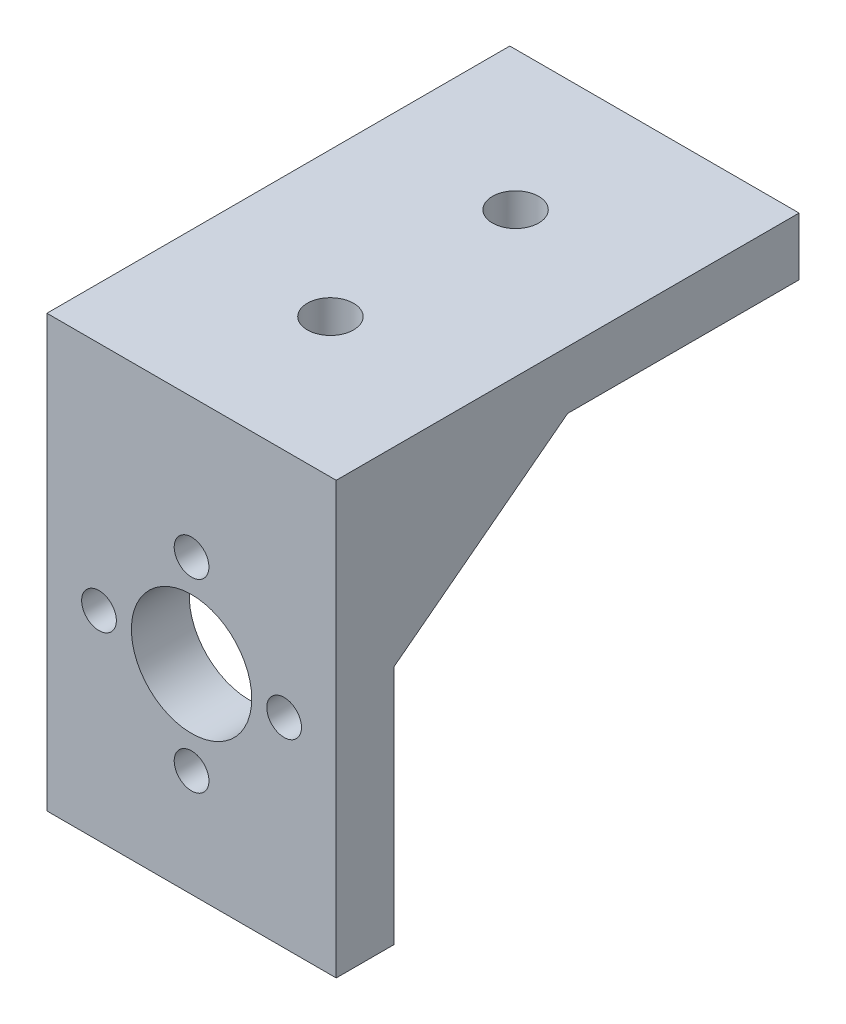
ISO-10303-21;
HEADER;
FILE_DESCRIPTION(('STEP AP214'),'2;1');
FILE_NAME('part.step','',(''),(''),'','','');
FILE_SCHEMA(('AUTOMOTIVE_DESIGN { 1 0 10303 214 1 1 1 1 }'));
ENDSEC;
DATA;
#1=APPLICATION_CONTEXT('core data for automotive mechanical design processes');
#2=APPLICATION_PROTOCOL_DEFINITION('international standard','automotive_design',2000,#1);
#3=PRODUCT_CONTEXT('',#1,'mechanical');
#4=PRODUCT('Part','Part','',(#3));
#5=PRODUCT_RELATED_PRODUCT_CATEGORY('part','',(#4));
#6=PRODUCT_DEFINITION_FORMATION('','',#4);
#7=PRODUCT_DEFINITION_CONTEXT('part definition',#1,'design');
#8=PRODUCT_DEFINITION('design','',#6,#7);
#9=PRODUCT_DEFINITION_SHAPE('','',#8);
#10=(LENGTH_UNIT() NAMED_UNIT(*) SI_UNIT(.MILLI.,.METRE.));
#11=(NAMED_UNIT(*) PLANE_ANGLE_UNIT() SI_UNIT($,.RADIAN.));
#12=(NAMED_UNIT(*) SI_UNIT($,.STERADIAN.) SOLID_ANGLE_UNIT());
#13=UNCERTAINTY_MEASURE_WITH_UNIT(LENGTH_MEASURE(1.E-05),#10,'distance_accuracy_value','');
#14=(GEOMETRIC_REPRESENTATION_CONTEXT(3) GLOBAL_UNCERTAINTY_ASSIGNED_CONTEXT((#13)) GLOBAL_UNIT_ASSIGNED_CONTEXT((#10,
#11,#12)) REPRESENTATION_CONTEXT('',''));
#15=CARTESIAN_POINT('',(0.,0.,0.));
#16=DIRECTION('',(0.,0.,1.));
#17=DIRECTION('',(1.,0.,0.));
#18=AXIS2_PLACEMENT_3D('',#15,#16,#17);
#19=CARTESIAN_POINT('',(0.,0.,0.));
#20=DIRECTION('',(0.,-1.,0.));
#21=DIRECTION('',(0.,0.,-1.));
#22=AXIS2_PLACEMENT_3D('',#19,#20,#21);
#23=PLANE('',#22);
#24=CARTESIAN_POINT('',(0.,0.,8.));
#25=DIRECTION('',(0.,-1.,0.));
#26=DIRECTION('',(0.,0.,-1.));
#27=AXIS2_PLACEMENT_3D('',#24,#25,#26);
#28=CIRCLE('',#27,2.);
#29=CARTESIAN_POINT('',(0.,0.,6.));
#30=VERTEX_POINT('',#29);
#31=EDGE_CURVE('E184',#30,#30,#28,.F.);
#32=ORIENTED_EDGE('',*,*,#31,.T.);
#33=EDGE_LOOP('',(#32));
#34=FACE_BOUND('',#33,.T.);
#35=CARTESIAN_POINT('',(0.,0.,-8.));
#36=DIRECTION('',(0.,-1.,0.));
#37=DIRECTION('',(0.,0.,-1.));
#38=AXIS2_PLACEMENT_3D('',#35,#36,#37);
#39=CIRCLE('',#38,2.);
#40=CARTESIAN_POINT('',(0.,0.,-10.));
#41=VERTEX_POINT('',#40);
#42=EDGE_CURVE('E188',#41,#41,#39,.T.);
#43=ORIENTED_EDGE('',*,*,#42,.F.);
#44=EDGE_LOOP('',(#43));
#45=FACE_BOUND('',#44,.T.);
#46=DIRECTION('',(0.,0.,-1.));
#47=VECTOR('',#46,1.);
#48=CARTESIAN_POINT('',(12.5,0.,-20.));
#49=LINE('',#48,#47);
#50=CARTESIAN_POINT('',(12.5,0.,0.));
#51=VERTEX_POINT('',#50);
#52=CARTESIAN_POINT('',(12.5,0.,-20.));
#53=VERTEX_POINT('',#52);
#54=EDGE_CURVE('E202',#51,#53,#49,.T.);
#55=ORIENTED_EDGE('',*,*,#54,.F.);
#56=DIRECTION('',(1.,0.,0.));
#57=VECTOR('',#56,1.);
#58=CARTESIAN_POINT('',(9.5,0.,0.));
#59=LINE('',#58,#57);
#60=CARTESIAN_POINT('',(9.5,0.,0.));
#61=VERTEX_POINT('',#60);
#62=EDGE_CURVE('E128',#61,#51,#59,.T.);
#63=ORIENTED_EDGE('',*,*,#62,.F.);
#64=DIRECTION('',(0.,0.,-1.));
#65=VECTOR('',#64,1.);
#66=CARTESIAN_POINT('',(9.5,0.,15.));
#67=LINE('',#66,#65);
#68=CARTESIAN_POINT('',(9.5,0.,15.));
#69=VERTEX_POINT('',#68);
#70=EDGE_CURVE('E116',#69,#61,#67,.T.);
#71=ORIENTED_EDGE('',*,*,#70,.F.);
#72=DIRECTION('',(1.,0.,0.));
#73=VECTOR('',#72,1.);
#74=CARTESIAN_POINT('',(12.5,0.,15.));
#75=LINE('',#74,#73);
#76=CARTESIAN_POINT('',(-9.49999999999999,0.,15.));
#77=VERTEX_POINT('',#76);
#78=EDGE_CURVE('E132',#77,#69,#75,.T.);
#79=ORIENTED_EDGE('',*,*,#78,.F.);
#80=DIRECTION('',(0.,0.,-1.));
#81=VECTOR('',#80,1.);
#82=CARTESIAN_POINT('',(-9.5,0.,15.));
#83=LINE('',#82,#81);
#84=CARTESIAN_POINT('',(-9.5,0.,0.));
#85=VERTEX_POINT('',#84);
#86=EDGE_CURVE('E50',#77,#85,#83,.T.);
#87=ORIENTED_EDGE('',*,*,#86,.T.);
#88=DIRECTION('',(-1.,0.,0.));
#89=VECTOR('',#88,1.);
#90=CARTESIAN_POINT('',(-9.5,0.,0.));
#91=LINE('',#90,#89);
#92=CARTESIAN_POINT('',(-12.5,0.,0.));
#93=VERTEX_POINT('',#92);
#94=EDGE_CURVE('E54',#85,#93,#91,.T.);
#95=ORIENTED_EDGE('',*,*,#94,.T.);
#96=DIRECTION('',(0.,0.,1.));
#97=VECTOR('',#96,1.);
#98=CARTESIAN_POINT('',(-12.5,0.,-20.));
#99=LINE('',#98,#97);
#100=CARTESIAN_POINT('',(-12.5,0.,-20.));
#101=VERTEX_POINT('',#100);
#102=EDGE_CURVE('E200',#101,#93,#99,.T.);
#103=ORIENTED_EDGE('',*,*,#102,.F.);
#104=DIRECTION('',(-1.,0.,0.));
#105=VECTOR('',#104,1.);
#106=CARTESIAN_POINT('',(12.5,0.,-20.));
#107=LINE('',#106,#105);
#108=EDGE_CURVE('E193',#53,#101,#107,.T.);
#109=ORIENTED_EDGE('',*,*,#108,.F.);
#110=EDGE_LOOP('',(#55,#63,#71,#79,#87,#95,#103,#109));
#111=FACE_BOUND('',#110,.T.);
#112=ADVANCED_FACE('F33',(#34,#45,#111),#23,.T.);
#113=CARTESIAN_POINT('',(12.5,-32.25,15.));
#114=DIRECTION('',(0.,0.,1.));
#115=DIRECTION('',(1.,0.,0.));
#116=AXIS2_PLACEMENT_3D('',#113,#114,#115);
#117=PLANE('',#116);
#118=CARTESIAN_POINT('',(0.,-15.,15.));
#119=DIRECTION('',(0.,0.,1.));
#120=DIRECTION('',(1.,0.,0.));
#121=AXIS2_PLACEMENT_3D('',#118,#119,#120);
#122=CIRCLE('',#121,5.2);
#123=CARTESIAN_POINT('',(5.2,-15.,15.));
#124=VERTEX_POINT('',#123);
#125=EDGE_CURVE('E37',#124,#124,#122,.T.);
#126=ORIENTED_EDGE('',*,*,#125,.T.);
#127=EDGE_LOOP('',(#126));
#128=FACE_BOUND('',#127,.T.);
#129=CARTESIAN_POINT('',(0.,-7.,15.));
#130=DIRECTION('',(0.,0.,1.));
#131=DIRECTION('',(1.,0.,0.));
#132=AXIS2_PLACEMENT_3D('',#129,#130,#131);
#133=CIRCLE('',#132,1.5);
#134=CARTESIAN_POINT('',(1.5,-7.,15.));
#135=VERTEX_POINT('',#134);
#136=EDGE_CURVE('E163',#135,#135,#133,.T.);
#137=ORIENTED_EDGE('',*,*,#136,.T.);
#138=EDGE_LOOP('',(#137));
#139=FACE_BOUND('',#138,.T.);
#140=CARTESIAN_POINT('',(8.,-14.9999999999999,15.));
#141=DIRECTION('',(0.,0.,1.));
#142=DIRECTION('',(1.,0.,0.));
#143=AXIS2_PLACEMENT_3D('',#140,#141,#142);
#144=CIRCLE('',#143,1.5);
#145=CARTESIAN_POINT('',(9.5,-14.9999999999999,15.));
#146=VERTEX_POINT('',#145);
#147=EDGE_CURVE('E153',#146,#146,#144,.T.);
#148=ORIENTED_EDGE('',*,*,#147,.T.);
#149=EDGE_LOOP('',(#148));
#150=FACE_BOUND('',#149,.T.);
#151=CARTESIAN_POINT('',(0.,-23.,15.));
#152=DIRECTION('',(0.,0.,1.));
#153=DIRECTION('',(1.,0.,0.));
#154=AXIS2_PLACEMENT_3D('',#151,#152,#153);
#155=CIRCLE('',#154,1.5);
#156=CARTESIAN_POINT('',(1.5,-23.,15.));
#157=VERTEX_POINT('',#156);
#158=EDGE_CURVE('E157',#157,#157,#155,.T.);
#159=ORIENTED_EDGE('',*,*,#158,.T.);
#160=EDGE_LOOP('',(#159));
#161=FACE_BOUND('',#160,.T.);
#162=CARTESIAN_POINT('',(-8.,-15.,15.));
#163=DIRECTION('',(0.,0.,1.));
#164=DIRECTION('',(1.,0.,0.));
#165=AXIS2_PLACEMENT_3D('',#162,#163,#164);
#166=CIRCLE('',#165,1.5);
#167=CARTESIAN_POINT('',(-6.5,-15.,15.));
#168=VERTEX_POINT('',#167);
#169=EDGE_CURVE('E160',#168,#168,#166,.T.);
#170=ORIENTED_EDGE('',*,*,#169,.T.);
#171=EDGE_LOOP('',(#170));
#172=FACE_BOUND('',#171,.T.);
#173=DIRECTION('',(1.,0.,0.));
#174=VECTOR('',#173,1.);
#175=CARTESIAN_POINT('',(9.5,-11.4463542998209,15.));
#176=LINE('',#175,#174);
#177=CARTESIAN_POINT('',(9.5,-11.4463542998209,15.));
#178=VERTEX_POINT('',#177);
#179=CARTESIAN_POINT('',(12.5,-11.4463542998209,15.));
#180=VERTEX_POINT('',#179);
#181=EDGE_CURVE('E121',#178,#180,#176,.T.);
#182=ORIENTED_EDGE('',*,*,#181,.T.);
#183=DIRECTION('',(0.,1.,0.));
#184=VECTOR('',#183,1.);
#185=CARTESIAN_POINT('',(12.5,-32.25,15.));
#186=LINE('',#185,#184);
#187=CARTESIAN_POINT('',(12.5,-32.25,15.));
#188=VERTEX_POINT('',#187);
#189=EDGE_CURVE('E176',#188,#180,#186,.T.);
#190=ORIENTED_EDGE('',*,*,#189,.F.);
#191=DIRECTION('',(1.,0.,0.));
#192=VECTOR('',#191,1.);
#193=CARTESIAN_POINT('',(12.5,-32.25,15.));
#194=LINE('',#193,#192);
#195=CARTESIAN_POINT('',(-12.5,-32.25,15.));
#196=VERTEX_POINT('',#195);
#197=EDGE_CURVE('E174',#196,#188,#194,.T.);
#198=ORIENTED_EDGE('',*,*,#197,.F.);
#199=DIRECTION('',(0.,1.,0.));
#200=VECTOR('',#199,1.);
#201=CARTESIAN_POINT('',(-12.5,-32.25,15.));
#202=LINE('',#201,#200);
#203=CARTESIAN_POINT('',(-12.5,-11.4463542998209,15.));
#204=VERTEX_POINT('',#203);
#205=EDGE_CURVE('E179',#196,#204,#202,.T.);
#206=ORIENTED_EDGE('',*,*,#205,.T.);
#207=DIRECTION('',(-1.,0.,0.));
#208=VECTOR('',#207,1.);
#209=CARTESIAN_POINT('',(-9.5,-11.4463542998209,15.));
#210=LINE('',#209,#208);
#211=CARTESIAN_POINT('',(-9.49999999999999,-11.4463542998209,15.));
#212=VERTEX_POINT('',#211);
#213=EDGE_CURVE('E150',#212,#204,#210,.T.);
#214=ORIENTED_EDGE('',*,*,#213,.F.);
#215=DIRECTION('',(0.,1.,0.));
#216=VECTOR('',#215,1.);
#217=CARTESIAN_POINT('',(-9.5,-11.4463542998209,15.));
#218=LINE('',#217,#216);
#219=EDGE_CURVE('E142',#212,#77,#218,.T.);
#220=ORIENTED_EDGE('',*,*,#219,.T.);
#221=ORIENTED_EDGE('',*,*,#78,.T.);
#222=DIRECTION('',(0.,1.,0.));
#223=VECTOR('',#222,1.);
#224=CARTESIAN_POINT('',(9.5,-11.4463542998209,15.));
#225=LINE('',#224,#223);
#226=EDGE_CURVE('E114',#178,#69,#225,.T.);
#227=ORIENTED_EDGE('',*,*,#226,.F.);
#228=EDGE_LOOP('',(#182,#190,#198,#206,#214,#220,#221,#227));
#229=FACE_BOUND('',#228,.T.);
#230=ADVANCED_FACE('F131',(#128,#139,#150,#161,#172,#229),#117,.F.);
#231=CARTESIAN_POINT('',(-12.5,5.,-20.));
#232=DIRECTION('',(1.,0.,0.));
#233=DIRECTION('',(0.,0.,-1.));
#234=AXIS2_PLACEMENT_3D('',#231,#232,#233);
#235=PLANE('',#234);
#236=ORIENTED_EDGE('',*,*,#102,.T.);
#237=DIRECTION('',(0.,-0.60663935358991,0.794977166134988));
#238=VECTOR('',#237,1.);
#239=CARTESIAN_POINT('',(-12.5,0.,0.));
#240=LINE('',#239,#238);
#241=EDGE_CURVE('E140',#93,#204,#240,.T.);
#242=ORIENTED_EDGE('',*,*,#241,.T.);
#243=ORIENTED_EDGE('',*,*,#205,.F.);
#244=DIRECTION('',(0.,0.,-1.));
#245=VECTOR('',#244,1.);
#246=CARTESIAN_POINT('',(-12.5,-32.25,20.));
#247=LINE('',#246,#245);
#248=CARTESIAN_POINT('',(-12.5,-32.25,20.));
#249=VERTEX_POINT('',#248);
#250=EDGE_CURVE('E172',#249,#196,#247,.T.);
#251=ORIENTED_EDGE('',*,*,#250,.F.);
#252=DIRECTION('',(0.,-1.,0.));
#253=VECTOR('',#252,1.);
#254=CARTESIAN_POINT('',(-12.5,5.,20.));
#255=LINE('',#254,#253);
#256=CARTESIAN_POINT('',(-12.5,5.,20.));
#257=VERTEX_POINT('',#256);
#258=EDGE_CURVE('E11',#257,#249,#255,.T.);
#259=ORIENTED_EDGE('',*,*,#258,.F.);
#260=DIRECTION('',(0.,0.,1.));
#261=VECTOR('',#260,1.);
#262=CARTESIAN_POINT('',(-12.5,5.,-20.));
#263=LINE('',#262,#261);
#264=CARTESIAN_POINT('',(-12.5,5.,-20.));
#265=VERTEX_POINT('',#264);
#266=EDGE_CURVE('E189',#265,#257,#263,.T.);
#267=ORIENTED_EDGE('',*,*,#266,.F.);
#268=DIRECTION('',(0.,-1.,0.));
#269=VECTOR('',#268,1.);
#270=CARTESIAN_POINT('',(-12.5,5.,-20.));
#271=LINE('',#270,#269);
#272=EDGE_CURVE('E199',#265,#101,#271,.T.);
#273=ORIENTED_EDGE('',*,*,#272,.T.);
#274=EDGE_LOOP('',(#236,#242,#243,#251,#259,#267,#273));
#275=FACE_BOUND('',#274,.T.);
#276=ADVANCED_FACE('F35',(#275),#235,.F.);
#277=CARTESIAN_POINT('',(12.5,5.,20.));
#278=DIRECTION('',(0.,0.,-1.));
#279=DIRECTION('',(-1.,0.,0.));
#280=AXIS2_PLACEMENT_3D('',#277,#278,#279);
#281=PLANE('',#280);
#282=ORIENTED_EDGE('',*,*,#258,.T.);
#283=DIRECTION('',(-1.,0.,0.));
#284=VECTOR('',#283,1.);
#285=CARTESIAN_POINT('',(12.5,-32.25,20.));
#286=LINE('',#285,#284);
#287=CARTESIAN_POINT('',(12.5,-32.25,20.));
#288=VERTEX_POINT('',#287);
#289=EDGE_CURVE('E169',#288,#249,#286,.T.);
#290=ORIENTED_EDGE('',*,*,#289,.F.);
#291=DIRECTION('',(0.,-1.,0.));
#292=VECTOR('',#291,1.);
#293=CARTESIAN_POINT('',(12.5,5.,20.));
#294=LINE('',#293,#292);
#295=CARTESIAN_POINT('',(12.5,5.,20.));
#296=VERTEX_POINT('',#295);
#297=EDGE_CURVE('E42',#296,#288,#294,.T.);
#298=ORIENTED_EDGE('',*,*,#297,.F.);
#299=DIRECTION('',(1.,0.,0.));
#300=VECTOR('',#299,1.);
#301=CARTESIAN_POINT('',(12.5,5.,20.));
#302=LINE('',#301,#300);
#303=EDGE_CURVE('E192',#257,#296,#302,.T.);
#304=ORIENTED_EDGE('',*,*,#303,.F.);
#305=EDGE_LOOP('',(#282,#290,#298,#304));
#306=FACE_BOUND('',#305,.T.);
#307=CARTESIAN_POINT('',(8.,-14.9999999999999,20.));
#308=DIRECTION('',(0.,0.,1.));
#309=DIRECTION('',(1.,0.,0.));
#310=AXIS2_PLACEMENT_3D('',#307,#308,#309);
#311=CIRCLE('',#310,1.5);
#312=CARTESIAN_POINT('',(9.5,-14.9999999999999,20.));
#313=VERTEX_POINT('',#312);
#314=EDGE_CURVE('E458',#313,#313,#311,.T.);
#315=ORIENTED_EDGE('',*,*,#314,.F.);
#316=EDGE_LOOP('',(#315));
#317=FACE_BOUND('',#316,.T.);
#318=CARTESIAN_POINT('',(0.,-7.,20.));
#319=DIRECTION('',(0.,0.,1.));
#320=DIRECTION('',(1.,0.,0.));
#321=AXIS2_PLACEMENT_3D('',#318,#319,#320);
#322=CIRCLE('',#321,1.5);
#323=CARTESIAN_POINT('',(1.5,-7.,20.));
#324=VERTEX_POINT('',#323);
#325=EDGE_CURVE('E465',#324,#324,#322,.T.);
#326=ORIENTED_EDGE('',*,*,#325,.F.);
#327=EDGE_LOOP('',(#326));
#328=FACE_BOUND('',#327,.T.);
#329=CARTESIAN_POINT('',(0.,-15.,20.));
#330=DIRECTION('',(0.,0.,1.));
#331=DIRECTION('',(1.,0.,0.));
#332=AXIS2_PLACEMENT_3D('',#329,#330,#331);
#333=CIRCLE('',#332,5.2);
#334=CARTESIAN_POINT('',(5.2,-15.,20.));
#335=VERTEX_POINT('',#334);
#336=EDGE_CURVE('E134',#335,#335,#333,.T.);
#337=ORIENTED_EDGE('',*,*,#336,.F.);
#338=EDGE_LOOP('',(#337));
#339=FACE_BOUND('',#338,.T.);
#340=CARTESIAN_POINT('',(-8.,-15.,20.));
#341=DIRECTION('',(0.,0.,1.));
#342=DIRECTION('',(1.,0.,0.));
#343=AXIS2_PLACEMENT_3D('',#340,#341,#342);
#344=CIRCLE('',#343,1.5);
#345=CARTESIAN_POINT('',(-6.5,-15.,20.));
#346=VERTEX_POINT('',#345);
#347=EDGE_CURVE('E461',#346,#346,#344,.T.);
#348=ORIENTED_EDGE('',*,*,#347,.F.);
#349=EDGE_LOOP('',(#348));
#350=FACE_BOUND('',#349,.T.);
#351=CARTESIAN_POINT('',(0.,-23.,20.));
#352=DIRECTION('',(0.,0.,1.));
#353=DIRECTION('',(1.,0.,0.));
#354=AXIS2_PLACEMENT_3D('',#351,#352,#353);
#355=CIRCLE('',#354,1.5);
#356=CARTESIAN_POINT('',(1.5,-23.,20.));
#357=VERTEX_POINT('',#356);
#358=EDGE_CURVE('E456',#357,#357,#355,.T.);
#359=ORIENTED_EDGE('',*,*,#358,.F.);
#360=EDGE_LOOP('',(#359));
#361=FACE_BOUND('',#360,.T.);
#362=ADVANCED_FACE('F242',(#306,#317,#328,#339,#350,#361),#281,.F.);
#363=CARTESIAN_POINT('',(12.5,5.,-20.));
#364=DIRECTION('',(-1.,0.,0.));
#365=DIRECTION('',(0.,0.,1.));
#366=AXIS2_PLACEMENT_3D('',#363,#364,#365);
#367=PLANE('',#366);
#368=DIRECTION('',(0.,-0.60663935358991,0.794977166134988));
#369=VECTOR('',#368,1.);
#370=CARTESIAN_POINT('',(12.5,0.,0.));
#371=LINE('',#370,#369);
#372=EDGE_CURVE('E124',#51,#180,#371,.T.);
#373=ORIENTED_EDGE('',*,*,#372,.F.);
#374=ORIENTED_EDGE('',*,*,#54,.T.);
#375=DIRECTION('',(0.,-1.,0.));
#376=VECTOR('',#375,1.);
#377=CARTESIAN_POINT('',(12.5,5.,-20.));
#378=LINE('',#377,#376);
#379=CARTESIAN_POINT('',(12.5,5.,-20.));
#380=VERTEX_POINT('',#379);
#381=EDGE_CURVE('E207',#380,#53,#378,.T.);
#382=ORIENTED_EDGE('',*,*,#381,.F.);
#383=DIRECTION('',(0.,0.,-1.));
#384=VECTOR('',#383,1.);
#385=CARTESIAN_POINT('',(12.5,5.,-20.));
#386=LINE('',#385,#384);
#387=EDGE_CURVE('E195',#296,#380,#386,.T.);
#388=ORIENTED_EDGE('',*,*,#387,.F.);
#389=ORIENTED_EDGE('',*,*,#297,.T.);
#390=DIRECTION('',(0.,0.,1.));
#391=VECTOR('',#390,1.);
#392=CARTESIAN_POINT('',(12.5,-32.25,20.));
#393=LINE('',#392,#391);
#394=EDGE_CURVE('E166',#188,#288,#393,.T.);
#395=ORIENTED_EDGE('',*,*,#394,.F.);
#396=ORIENTED_EDGE('',*,*,#189,.T.);
#397=EDGE_LOOP('',(#373,#374,#382,#388,#389,#395,#396));
#398=FACE_BOUND('',#397,.T.);
#399=ADVANCED_FACE('F248',(#398),#367,.F.);
#400=CARTESIAN_POINT('',(12.5,5.,-20.));
#401=DIRECTION('',(0.,0.,1.));
#402=DIRECTION('',(1.,0.,0.));
#403=AXIS2_PLACEMENT_3D('',#400,#401,#402);
#404=PLANE('',#403);
#405=ORIENTED_EDGE('',*,*,#108,.T.);
#406=ORIENTED_EDGE('',*,*,#272,.F.);
#407=DIRECTION('',(-1.,0.,0.));
#408=VECTOR('',#407,1.);
#409=CARTESIAN_POINT('',(12.5,5.,-20.));
#410=LINE('',#409,#408);
#411=EDGE_CURVE('E197',#380,#265,#410,.T.);
#412=ORIENTED_EDGE('',*,*,#411,.F.);
#413=ORIENTED_EDGE('',*,*,#381,.T.);
#414=EDGE_LOOP('',(#405,#406,#412,#413));
#415=FACE_BOUND('',#414,.T.);
#416=ADVANCED_FACE('F228',(#415),#404,.F.);
#417=CARTESIAN_POINT('',(0.,5.,0.));
#418=DIRECTION('',(0.,-1.,0.));
#419=DIRECTION('',(0.,0.,-1.));
#420=AXIS2_PLACEMENT_3D('',#417,#418,#419);
#421=PLANE('',#420);
#422=CARTESIAN_POINT('',(0.,5.,8.));
#423=DIRECTION('',(0.,-1.,0.));
#424=DIRECTION('',(0.,0.,-1.));
#425=AXIS2_PLACEMENT_3D('',#422,#423,#424);
#426=CIRCLE('',#425,2.);
#427=CARTESIAN_POINT('',(0.,5.,6.));
#428=VERTEX_POINT('',#427);
#429=EDGE_CURVE('E181',#428,#428,#426,.T.);
#430=ORIENTED_EDGE('',*,*,#429,.T.);
#431=EDGE_LOOP('',(#430));
#432=FACE_BOUND('',#431,.T.);
#433=CARTESIAN_POINT('',(0.,5.,-8.));
#434=DIRECTION('',(0.,1.,0.));
#435=DIRECTION('',(0.,0.,1.));
#436=AXIS2_PLACEMENT_3D('',#433,#434,#435);
#437=CIRCLE('',#436,2.);
#438=CARTESIAN_POINT('',(0.,5.,-6.));
#439=VERTEX_POINT('',#438);
#440=EDGE_CURVE('E185',#439,#439,#437,.T.);
#441=ORIENTED_EDGE('',*,*,#440,.F.);
#442=EDGE_LOOP('',(#441));
#443=FACE_BOUND('',#442,.T.);
#444=ORIENTED_EDGE('',*,*,#266,.T.);
#445=ORIENTED_EDGE('',*,*,#303,.T.);
#446=ORIENTED_EDGE('',*,*,#387,.T.);
#447=ORIENTED_EDGE('',*,*,#411,.T.);
#448=EDGE_LOOP('',(#444,#445,#446,#447));
#449=FACE_BOUND('',#448,.T.);
#450=ADVANCED_FACE('F225',(#432,#443,#449),#421,.F.);
#451=CARTESIAN_POINT('',(0.,-6.5,-8.));
#452=DIRECTION('',(0.,1.,0.));
#453=DIRECTION('',(0.,0.,1.));
#454=AXIS2_PLACEMENT_3D('',#451,#452,#453);
#455=CYLINDRICAL_SURFACE('',#454,2.);
#456=ORIENTED_EDGE('',*,*,#42,.T.);
#457=EDGE_LOOP('',(#456));
#458=FACE_BOUND('',#457,.T.);
#459=ORIENTED_EDGE('',*,*,#440,.T.);
#460=EDGE_LOOP('',(#459));
#461=FACE_BOUND('',#460,.T.);
#462=ADVANCED_FACE('F221',(#458,#461),#455,.F.);
#463=CARTESIAN_POINT('',(0.,-6.5,8.));
#464=DIRECTION('',(0.,1.,0.));
#465=DIRECTION('',(0.,0.,1.));
#466=AXIS2_PLACEMENT_3D('',#463,#464,#465);
#467=CYLINDRICAL_SURFACE('',#466,2.);
#468=ORIENTED_EDGE('',*,*,#31,.F.);
#469=EDGE_LOOP('',(#468));
#470=FACE_BOUND('',#469,.T.);
#471=ORIENTED_EDGE('',*,*,#429,.F.);
#472=EDGE_LOOP('',(#471));
#473=FACE_BOUND('',#472,.T.);
#474=ADVANCED_FACE('F217',(#470,#473),#467,.F.);
#475=CARTESIAN_POINT('',(0.,-32.25,0.));
#476=DIRECTION('',(0.,1.,0.));
#477=DIRECTION('',(0.,0.,1.));
#478=AXIS2_PLACEMENT_3D('',#475,#476,#477);
#479=PLANE('',#478);
#480=ORIENTED_EDGE('',*,*,#394,.T.);
#481=ORIENTED_EDGE('',*,*,#289,.T.);
#482=ORIENTED_EDGE('',*,*,#250,.T.);
#483=ORIENTED_EDGE('',*,*,#197,.T.);
#484=EDGE_LOOP('',(#480,#481,#482,#483));
#485=FACE_BOUND('',#484,.T.);
#486=ADVANCED_FACE('F220',(#485),#479,.F.);
#487=CARTESIAN_POINT('',(0.,-15.,7.99999999999999));
#488=DIRECTION('',(0.,0.,1.));
#489=DIRECTION('',(1.,0.,0.));
#490=AXIS2_PLACEMENT_3D('',#487,#488,#489);
#491=CYLINDRICAL_SURFACE('',#490,5.2);
#492=CARTESIAN_POINT('',(5.2,-15.,15.));
#493=CARTESIAN_POINT('',(5.2,-15.,15.0520833333333));
#494=CARTESIAN_POINT('',(5.2,-15.,15.1041666666667));
#495=CARTESIAN_POINT('',(5.2,-15.,15.2083333333333));
#496=CARTESIAN_POINT('',(5.2,-15.,15.2604166666667));
#497=CARTESIAN_POINT('',(5.2,-15.,15.3645833333333));
#498=CARTESIAN_POINT('',(5.2,-15.,15.4166666666667));
#499=CARTESIAN_POINT('',(5.2,-15.,15.5208333333333));
#500=CARTESIAN_POINT('',(5.2,-15.,15.5729166666667));
#501=CARTESIAN_POINT('',(5.2,-15.,15.6770833333333));
#502=CARTESIAN_POINT('',(5.2,-15.,15.7291666666667));
#503=CARTESIAN_POINT('',(5.2,-15.,15.8333333333333));
#504=CARTESIAN_POINT('',(5.2,-15.,15.8854166666667));
#505=CARTESIAN_POINT('',(5.2,-15.,15.9895833333333));
#506=CARTESIAN_POINT('',(5.2,-15.,16.0416666666667));
#507=CARTESIAN_POINT('',(5.2,-15.,16.1458333333333));
#508=CARTESIAN_POINT('',(5.2,-15.,16.1979166666667));
#509=CARTESIAN_POINT('',(5.2,-15.,16.3020833333333));
#510=CARTESIAN_POINT('',(5.2,-15.,16.3541666666667));
#511=CARTESIAN_POINT('',(5.2,-15.,16.4583333333333));
#512=CARTESIAN_POINT('',(5.2,-15.,16.5104166666667));
#513=CARTESIAN_POINT('',(5.2,-15.,16.6145833333333));
#514=CARTESIAN_POINT('',(5.2,-15.,16.6666666666667));
#515=CARTESIAN_POINT('',(5.2,-15.,16.7708333333333));
#516=CARTESIAN_POINT('',(5.2,-15.,16.8229166666667));
#517=CARTESIAN_POINT('',(5.2,-15.,16.9270833333333));
#518=CARTESIAN_POINT('',(5.2,-15.,16.9791666666667));
#519=CARTESIAN_POINT('',(5.2,-15.,17.0833333333333));
#520=CARTESIAN_POINT('',(5.2,-15.,17.1354166666667));
#521=CARTESIAN_POINT('',(5.2,-15.,17.2395833333333));
#522=CARTESIAN_POINT('',(5.2,-15.,17.2916666666667));
#523=CARTESIAN_POINT('',(5.2,-15.,17.3958333333333));
#524=CARTESIAN_POINT('',(5.2,-15.,17.4479166666667));
#525=CARTESIAN_POINT('',(5.2,-15.,17.5520833333333));
#526=CARTESIAN_POINT('',(5.2,-15.,17.6041666666667));
#527=CARTESIAN_POINT('',(5.2,-15.,17.7083333333333));
#528=CARTESIAN_POINT('',(5.2,-15.,17.7604166666667));
#529=CARTESIAN_POINT('',(5.2,-15.,17.8645833333333));
#530=CARTESIAN_POINT('',(5.2,-15.,17.9166666666667));
#531=CARTESIAN_POINT('',(5.2,-15.,18.0208333333333));
#532=CARTESIAN_POINT('',(5.2,-15.,18.0729166666667));
#533=CARTESIAN_POINT('',(5.2,-15.,18.1770833333333));
#534=CARTESIAN_POINT('',(5.2,-15.,18.2291666666667));
#535=CARTESIAN_POINT('',(5.2,-15.,18.3333333333333));
#536=CARTESIAN_POINT('',(5.2,-15.,18.3854166666667));
#537=CARTESIAN_POINT('',(5.2,-15.,18.4895833333333));
#538=CARTESIAN_POINT('',(5.2,-15.,18.5416666666667));
#539=CARTESIAN_POINT('',(5.2,-15.,18.6458333333333));
#540=CARTESIAN_POINT('',(5.2,-15.,18.6979166666667));
#541=CARTESIAN_POINT('',(5.2,-15.,18.8020833333333));
#542=CARTESIAN_POINT('',(5.2,-15.,18.8541666666667));
#543=CARTESIAN_POINT('',(5.2,-15.,18.9583333333333));
#544=CARTESIAN_POINT('',(5.2,-15.,19.0104166666667));
#545=CARTESIAN_POINT('',(5.2,-15.,19.1145833333333));
#546=CARTESIAN_POINT('',(5.2,-15.,19.1666666666667));
#547=CARTESIAN_POINT('',(5.2,-15.,19.2708333333333));
#548=CARTESIAN_POINT('',(5.2,-15.,19.3229166666667));
#549=CARTESIAN_POINT('',(5.2,-15.,19.4270833333333));
#550=CARTESIAN_POINT('',(5.2,-15.,19.4791666666667));
#551=CARTESIAN_POINT('',(5.2,-15.,19.5833333333333));
#552=CARTESIAN_POINT('',(5.2,-15.,19.6354166666667));
#553=CARTESIAN_POINT('',(5.2,-15.,19.7395833333333));
#554=CARTESIAN_POINT('',(5.2,-15.,19.7916666666667));
#555=CARTESIAN_POINT('',(5.2,-15.,19.8958333333333));
#556=CARTESIAN_POINT('',(5.2,-15.,19.9479166666667));
#557=CARTESIAN_POINT('',(5.2,-15.,20.));
#558=B_SPLINE_CURVE_WITH_KNOTS('',3,(#492,#493,#494,#495,#496,#497,#498,#499,#500,#501,#502,
#503,#504,#505,#506,#507,#508,#509,#510,#511,#512,#513,#514,#515,#516,#517,#518,#519,#520,#521,
#522,#523,#524,#525,#526,#527,#528,#529,#530,#531,#532,#533,#534,#535,#536,#537,#538,#539,#540,
#541,#542,#543,#544,#545,#546,#547,#548,#549,#550,#551,#552,#553,#554,#555,#556,#557),
.UNSPECIFIED.,.F.,.F.,(4,2,2,2,2,2,2,2,2,2,2,2,2,2,2,2,2,2,2,2,2,2,2,2,2,2,2,2,2,2,2,2,4),(0.,
0.15625,0.312499999999999,0.468749999999999,0.624999999999997,0.781249999999997,
0.937499999999997,1.09375,1.25,1.40624999999999,1.5625,1.71874999999999,1.87499999999999,
2.03124999999999,2.1875,2.34375,2.5,2.65625,2.81249999999999,2.96875,3.12499999999999,
3.28124999999999,3.43749999999999,3.59374999999999,3.74999999999999,3.90624999999999,
4.06249999999999,4.21874999999999,4.37499999999999,4.53124999999999,4.68749999999999,
4.84374999999999,4.99999999999999),.UNSPECIFIED.);
#559=EDGE_CURVE('BSEAM333',#124,#335,#558,.T.);
#560=ORIENTED_EDGE('',*,*,#125,.F.);
#561=ORIENTED_EDGE('',*,*,#336,.T.);
#562=ORIENTED_EDGE('',*,*,#559,.T.);
#563=ORIENTED_EDGE('',*,*,#559,.F.);
#564=EDGE_LOOP('',(#560,#562,#561,#563));
#565=FACE_BOUND('',#564,.T.);
#566=ADVANCED_FACE('F333',(#565),#491,.F.);
#567=CARTESIAN_POINT('',(0.,-7.,7.99999999999999));
#568=DIRECTION('',(0.,0.,1.));
#569=DIRECTION('',(1.,0.,0.));
#570=AXIS2_PLACEMENT_3D('',#567,#568,#569);
#571=CYLINDRICAL_SURFACE('',#570,1.5);
#572=CARTESIAN_POINT('',(1.5,-7.,15.));
#573=CARTESIAN_POINT('',(1.5,-7.,15.0520833333333));
#574=CARTESIAN_POINT('',(1.5,-7.,15.1041666666667));
#575=CARTESIAN_POINT('',(1.5,-7.,15.2083333333333));
#576=CARTESIAN_POINT('',(1.5,-7.,15.2604166666667));
#577=CARTESIAN_POINT('',(1.5,-7.,15.3645833333333));
#578=CARTESIAN_POINT('',(1.5,-7.,15.4166666666667));
#579=CARTESIAN_POINT('',(1.5,-7.,15.5208333333333));
#580=CARTESIAN_POINT('',(1.5,-7.,15.5729166666667));
#581=CARTESIAN_POINT('',(1.5,-7.,15.6770833333333));
#582=CARTESIAN_POINT('',(1.5,-7.,15.7291666666667));
#583=CARTESIAN_POINT('',(1.5,-7.,15.8333333333333));
#584=CARTESIAN_POINT('',(1.5,-7.,15.8854166666667));
#585=CARTESIAN_POINT('',(1.5,-7.,15.9895833333333));
#586=CARTESIAN_POINT('',(1.5,-7.,16.0416666666667));
#587=CARTESIAN_POINT('',(1.5,-7.,16.1458333333333));
#588=CARTESIAN_POINT('',(1.5,-7.,16.1979166666667));
#589=CARTESIAN_POINT('',(1.5,-7.,16.3020833333333));
#590=CARTESIAN_POINT('',(1.5,-7.,16.3541666666667));
#591=CARTESIAN_POINT('',(1.5,-7.,16.4583333333333));
#592=CARTESIAN_POINT('',(1.5,-7.,16.5104166666667));
#593=CARTESIAN_POINT('',(1.5,-7.,16.6145833333333));
#594=CARTESIAN_POINT('',(1.5,-7.,16.6666666666667));
#595=CARTESIAN_POINT('',(1.5,-7.,16.7708333333333));
#596=CARTESIAN_POINT('',(1.5,-7.,16.8229166666667));
#597=CARTESIAN_POINT('',(1.5,-7.,16.9270833333333));
#598=CARTESIAN_POINT('',(1.5,-7.,16.9791666666667));
#599=CARTESIAN_POINT('',(1.5,-7.,17.0833333333333));
#600=CARTESIAN_POINT('',(1.5,-7.,17.1354166666667));
#601=CARTESIAN_POINT('',(1.5,-7.,17.2395833333333));
#602=CARTESIAN_POINT('',(1.5,-7.,17.2916666666667));
#603=CARTESIAN_POINT('',(1.5,-7.,17.3958333333333));
#604=CARTESIAN_POINT('',(1.5,-7.,17.4479166666667));
#605=CARTESIAN_POINT('',(1.5,-7.,17.5520833333333));
#606=CARTESIAN_POINT('',(1.5,-7.,17.6041666666667));
#607=CARTESIAN_POINT('',(1.5,-7.,17.7083333333333));
#608=CARTESIAN_POINT('',(1.5,-7.,17.7604166666667));
#609=CARTESIAN_POINT('',(1.5,-7.,17.8645833333333));
#610=CARTESIAN_POINT('',(1.5,-7.,17.9166666666667));
#611=CARTESIAN_POINT('',(1.5,-7.,18.0208333333333));
#612=CARTESIAN_POINT('',(1.5,-7.,18.0729166666667));
#613=CARTESIAN_POINT('',(1.5,-7.,18.1770833333333));
#614=CARTESIAN_POINT('',(1.5,-7.,18.2291666666667));
#615=CARTESIAN_POINT('',(1.5,-7.,18.3333333333333));
#616=CARTESIAN_POINT('',(1.5,-7.,18.3854166666667));
#617=CARTESIAN_POINT('',(1.5,-7.,18.4895833333333));
#618=CARTESIAN_POINT('',(1.5,-7.,18.5416666666667));
#619=CARTESIAN_POINT('',(1.5,-7.,18.6458333333333));
#620=CARTESIAN_POINT('',(1.5,-7.,18.6979166666667));
#621=CARTESIAN_POINT('',(1.5,-7.,18.8020833333333));
#622=CARTESIAN_POINT('',(1.5,-7.,18.8541666666667));
#623=CARTESIAN_POINT('',(1.5,-7.,18.9583333333333));
#624=CARTESIAN_POINT('',(1.5,-7.,19.0104166666667));
#625=CARTESIAN_POINT('',(1.5,-7.,19.1145833333333));
#626=CARTESIAN_POINT('',(1.5,-7.,19.1666666666667));
#627=CARTESIAN_POINT('',(1.5,-7.,19.2708333333333));
#628=CARTESIAN_POINT('',(1.5,-7.,19.3229166666667));
#629=CARTESIAN_POINT('',(1.5,-7.,19.4270833333333));
#630=CARTESIAN_POINT('',(1.5,-7.,19.4791666666667));
#631=CARTESIAN_POINT('',(1.5,-7.,19.5833333333333));
#632=CARTESIAN_POINT('',(1.5,-7.,19.6354166666667));
#633=CARTESIAN_POINT('',(1.5,-7.,19.7395833333333));
#634=CARTESIAN_POINT('',(1.5,-7.,19.7916666666667));
#635=CARTESIAN_POINT('',(1.5,-7.,19.8958333333333));
#636=CARTESIAN_POINT('',(1.5,-7.,19.9479166666667));
#637=CARTESIAN_POINT('',(1.5,-7.,20.));
#638=B_SPLINE_CURVE_WITH_KNOTS('',3,(#572,#573,#574,#575,#576,#577,#578,#579,#580,#581,#582,
#583,#584,#585,#586,#587,#588,#589,#590,#591,#592,#593,#594,#595,#596,#597,#598,#599,#600,#601,
#602,#603,#604,#605,#606,#607,#608,#609,#610,#611,#612,#613,#614,#615,#616,#617,#618,#619,#620,
#621,#622,#623,#624,#625,#626,#627,#628,#629,#630,#631,#632,#633,#634,#635,#636,#637),
.UNSPECIFIED.,.F.,.F.,(4,2,2,2,2,2,2,2,2,2,2,2,2,2,2,2,2,2,2,2,2,2,2,2,2,2,2,2,2,2,2,2,4),(0.,
0.15625,0.312499999999999,0.468749999999999,0.624999999999997,0.781249999999997,
0.937499999999997,1.09375,1.25,1.40624999999999,1.5625,1.71874999999999,1.87499999999999,
2.03124999999999,2.1875,2.34375,2.5,2.65625,2.81249999999999,2.96875,3.12499999999999,
3.28124999999999,3.43749999999999,3.59374999999999,3.74999999999999,3.90624999999999,
4.06249999999999,4.21874999999999,4.37499999999999,4.53124999999999,4.68749999999999,
4.84374999999999,4.99999999999999),.UNSPECIFIED.);
#639=EDGE_CURVE('BSEAM337',#135,#324,#638,.T.);
#640=ORIENTED_EDGE('',*,*,#136,.F.);
#641=ORIENTED_EDGE('',*,*,#325,.T.);
#642=ORIENTED_EDGE('',*,*,#639,.T.);
#643=ORIENTED_EDGE('',*,*,#639,.F.);
#644=EDGE_LOOP('',(#640,#642,#641,#643));
#645=FACE_BOUND('',#644,.T.);
#646=ADVANCED_FACE('F337',(#645),#571,.F.);
#647=CARTESIAN_POINT('',(8.,-14.9999999999999,7.99999999999999));
#648=DIRECTION('',(0.,0.,1.));
#649=DIRECTION('',(1.,0.,0.));
#650=AXIS2_PLACEMENT_3D('',#647,#648,#649);
#651=CYLINDRICAL_SURFACE('',#650,1.5);
#652=CARTESIAN_POINT('',(9.5,-14.9999999999999,15.));
#653=CARTESIAN_POINT('',(9.5,-14.9999999999999,15.0520833333333));
#654=CARTESIAN_POINT('',(9.5,-14.9999999999999,15.1041666666667));
#655=CARTESIAN_POINT('',(9.5,-14.9999999999999,15.2083333333333));
#656=CARTESIAN_POINT('',(9.5,-14.9999999999999,15.2604166666667));
#657=CARTESIAN_POINT('',(9.5,-14.9999999999999,15.3645833333333));
#658=CARTESIAN_POINT('',(9.5,-14.9999999999999,15.4166666666667));
#659=CARTESIAN_POINT('',(9.5,-14.9999999999999,15.5208333333333));
#660=CARTESIAN_POINT('',(9.5,-14.9999999999999,15.5729166666667));
#661=CARTESIAN_POINT('',(9.5,-14.9999999999999,15.6770833333333));
#662=CARTESIAN_POINT('',(9.5,-14.9999999999999,15.7291666666667));
#663=CARTESIAN_POINT('',(9.5,-14.9999999999999,15.8333333333333));
#664=CARTESIAN_POINT('',(9.5,-14.9999999999999,15.8854166666667));
#665=CARTESIAN_POINT('',(9.5,-14.9999999999999,15.9895833333333));
#666=CARTESIAN_POINT('',(9.5,-14.9999999999999,16.0416666666667));
#667=CARTESIAN_POINT('',(9.5,-14.9999999999999,16.1458333333333));
#668=CARTESIAN_POINT('',(9.5,-14.9999999999999,16.1979166666667));
#669=CARTESIAN_POINT('',(9.5,-14.9999999999999,16.3020833333333));
#670=CARTESIAN_POINT('',(9.5,-14.9999999999999,16.3541666666667));
#671=CARTESIAN_POINT('',(9.5,-14.9999999999999,16.4583333333333));
#672=CARTESIAN_POINT('',(9.5,-14.9999999999999,16.5104166666667));
#673=CARTESIAN_POINT('',(9.5,-14.9999999999999,16.6145833333333));
#674=CARTESIAN_POINT('',(9.5,-14.9999999999999,16.6666666666667));
#675=CARTESIAN_POINT('',(9.5,-14.9999999999999,16.7708333333333));
#676=CARTESIAN_POINT('',(9.5,-14.9999999999999,16.8229166666667));
#677=CARTESIAN_POINT('',(9.5,-14.9999999999999,16.9270833333333));
#678=CARTESIAN_POINT('',(9.5,-14.9999999999999,16.9791666666667));
#679=CARTESIAN_POINT('',(9.5,-14.9999999999999,17.0833333333333));
#680=CARTESIAN_POINT('',(9.5,-14.9999999999999,17.1354166666667));
#681=CARTESIAN_POINT('',(9.5,-14.9999999999999,17.2395833333333));
#682=CARTESIAN_POINT('',(9.5,-14.9999999999999,17.2916666666667));
#683=CARTESIAN_POINT('',(9.5,-14.9999999999999,17.3958333333333));
#684=CARTESIAN_POINT('',(9.5,-14.9999999999999,17.4479166666667));
#685=CARTESIAN_POINT('',(9.5,-14.9999999999999,17.5520833333333));
#686=CARTESIAN_POINT('',(9.5,-14.9999999999999,17.6041666666667));
#687=CARTESIAN_POINT('',(9.5,-14.9999999999999,17.7083333333333));
#688=CARTESIAN_POINT('',(9.5,-14.9999999999999,17.7604166666667));
#689=CARTESIAN_POINT('',(9.5,-14.9999999999999,17.8645833333333));
#690=CARTESIAN_POINT('',(9.5,-14.9999999999999,17.9166666666667));
#691=CARTESIAN_POINT('',(9.5,-14.9999999999999,18.0208333333333));
#692=CARTESIAN_POINT('',(9.5,-14.9999999999999,18.0729166666667));
#693=CARTESIAN_POINT('',(9.5,-14.9999999999999,18.1770833333333));
#694=CARTESIAN_POINT('',(9.5,-14.9999999999999,18.2291666666667));
#695=CARTESIAN_POINT('',(9.5,-14.9999999999999,18.3333333333333));
#696=CARTESIAN_POINT('',(9.5,-14.9999999999999,18.3854166666667));
#697=CARTESIAN_POINT('',(9.5,-14.9999999999999,18.4895833333333));
#698=CARTESIAN_POINT('',(9.5,-14.9999999999999,18.5416666666667));
#699=CARTESIAN_POINT('',(9.5,-14.9999999999999,18.6458333333333));
#700=CARTESIAN_POINT('',(9.5,-14.9999999999999,18.6979166666667));
#701=CARTESIAN_POINT('',(9.5,-14.9999999999999,18.8020833333333));
#702=CARTESIAN_POINT('',(9.5,-14.9999999999999,18.8541666666667));
#703=CARTESIAN_POINT('',(9.5,-14.9999999999999,18.9583333333333));
#704=CARTESIAN_POINT('',(9.5,-14.9999999999999,19.0104166666667));
#705=CARTESIAN_POINT('',(9.5,-14.9999999999999,19.1145833333333));
#706=CARTESIAN_POINT('',(9.5,-14.9999999999999,19.1666666666667));
#707=CARTESIAN_POINT('',(9.5,-14.9999999999999,19.2708333333333));
#708=CARTESIAN_POINT('',(9.5,-14.9999999999999,19.3229166666667));
#709=CARTESIAN_POINT('',(9.5,-14.9999999999999,19.4270833333333));
#710=CARTESIAN_POINT('',(9.5,-14.9999999999999,19.4791666666667));
#711=CARTESIAN_POINT('',(9.5,-14.9999999999999,19.5833333333333));
#712=CARTESIAN_POINT('',(9.5,-14.9999999999999,19.6354166666667));
#713=CARTESIAN_POINT('',(9.5,-14.9999999999999,19.7395833333333));
#714=CARTESIAN_POINT('',(9.5,-14.9999999999999,19.7916666666667));
#715=CARTESIAN_POINT('',(9.5,-14.9999999999999,19.8958333333333));
#716=CARTESIAN_POINT('',(9.5,-14.9999999999999,19.9479166666667));
#717=CARTESIAN_POINT('',(9.5,-14.9999999999999,20.));
#718=B_SPLINE_CURVE_WITH_KNOTS('',3,(#652,#653,#654,#655,#656,#657,#658,#659,#660,#661,#662,
#663,#664,#665,#666,#667,#668,#669,#670,#671,#672,#673,#674,#675,#676,#677,#678,#679,#680,#681,
#682,#683,#684,#685,#686,#687,#688,#689,#690,#691,#692,#693,#694,#695,#696,#697,#698,#699,#700,
#701,#702,#703,#704,#705,#706,#707,#708,#709,#710,#711,#712,#713,#714,#715,#716,#717),
.UNSPECIFIED.,.F.,.F.,(4,2,2,2,2,2,2,2,2,2,2,2,2,2,2,2,2,2,2,2,2,2,2,2,2,2,2,2,2,2,2,2,4),(0.,
0.15625,0.3125,0.46875,0.625000000000001,0.781250000000001,0.937499999999997,1.09375,1.25,
1.40625,1.5625,1.71874999999999,1.875,2.03124999999999,2.1875,2.34375,2.5,2.65625,2.8125,
2.96875,3.12499999999999,3.28125,3.43749999999999,3.59374999999999,3.74999999999999,
3.90624999999999,4.06249999999999,4.21874999999999,4.37499999999999,4.53124999999999,
4.68749999999999,4.84374999999999,4.99999999999999),.UNSPECIFIED.);
#719=EDGE_CURVE('BSEAM349',#146,#313,#718,.T.);
#720=ORIENTED_EDGE('',*,*,#147,.F.);
#721=ORIENTED_EDGE('',*,*,#314,.T.);
#722=ORIENTED_EDGE('',*,*,#719,.T.);
#723=ORIENTED_EDGE('',*,*,#719,.F.);
#724=EDGE_LOOP('',(#720,#722,#721,#723));
#725=FACE_BOUND('',#724,.T.);
#726=ADVANCED_FACE('F349',(#725),#651,.F.);
#727=CARTESIAN_POINT('',(0.,-23.,7.99999999999999));
#728=DIRECTION('',(0.,0.,1.));
#729=DIRECTION('',(1.,0.,0.));
#730=AXIS2_PLACEMENT_3D('',#727,#728,#729);
#731=CYLINDRICAL_SURFACE('',#730,1.5);
#732=CARTESIAN_POINT('',(1.5,-23.,15.));
#733=CARTESIAN_POINT('',(1.5,-23.,15.0520833333333));
#734=CARTESIAN_POINT('',(1.5,-23.,15.1041666666667));
#735=CARTESIAN_POINT('',(1.5,-23.,15.2083333333333));
#736=CARTESIAN_POINT('',(1.5,-23.,15.2604166666667));
#737=CARTESIAN_POINT('',(1.5,-23.,15.3645833333333));
#738=CARTESIAN_POINT('',(1.5,-23.,15.4166666666667));
#739=CARTESIAN_POINT('',(1.5,-23.,15.5208333333333));
#740=CARTESIAN_POINT('',(1.5,-23.,15.5729166666667));
#741=CARTESIAN_POINT('',(1.5,-23.,15.6770833333333));
#742=CARTESIAN_POINT('',(1.5,-23.,15.7291666666667));
#743=CARTESIAN_POINT('',(1.5,-23.,15.8333333333333));
#744=CARTESIAN_POINT('',(1.5,-23.,15.8854166666667));
#745=CARTESIAN_POINT('',(1.5,-23.,15.9895833333333));
#746=CARTESIAN_POINT('',(1.5,-23.,16.0416666666667));
#747=CARTESIAN_POINT('',(1.5,-23.,16.1458333333333));
#748=CARTESIAN_POINT('',(1.5,-23.,16.1979166666667));
#749=CARTESIAN_POINT('',(1.5,-23.,16.3020833333333));
#750=CARTESIAN_POINT('',(1.5,-23.,16.3541666666667));
#751=CARTESIAN_POINT('',(1.5,-23.,16.4583333333333));
#752=CARTESIAN_POINT('',(1.5,-23.,16.5104166666667));
#753=CARTESIAN_POINT('',(1.5,-23.,16.6145833333333));
#754=CARTESIAN_POINT('',(1.5,-23.,16.6666666666667));
#755=CARTESIAN_POINT('',(1.5,-23.,16.7708333333333));
#756=CARTESIAN_POINT('',(1.5,-23.,16.8229166666667));
#757=CARTESIAN_POINT('',(1.5,-23.,16.9270833333333));
#758=CARTESIAN_POINT('',(1.5,-23.,16.9791666666667));
#759=CARTESIAN_POINT('',(1.5,-23.,17.0833333333333));
#760=CARTESIAN_POINT('',(1.5,-23.,17.1354166666667));
#761=CARTESIAN_POINT('',(1.5,-23.,17.2395833333333));
#762=CARTESIAN_POINT('',(1.5,-23.,17.2916666666667));
#763=CARTESIAN_POINT('',(1.5,-23.,17.3958333333333));
#764=CARTESIAN_POINT('',(1.5,-23.,17.4479166666667));
#765=CARTESIAN_POINT('',(1.5,-23.,17.5520833333333));
#766=CARTESIAN_POINT('',(1.5,-23.,17.6041666666667));
#767=CARTESIAN_POINT('',(1.5,-23.,17.7083333333333));
#768=CARTESIAN_POINT('',(1.5,-23.,17.7604166666667));
#769=CARTESIAN_POINT('',(1.5,-23.,17.8645833333333));
#770=CARTESIAN_POINT('',(1.5,-23.,17.9166666666667));
#771=CARTESIAN_POINT('',(1.5,-23.,18.0208333333333));
#772=CARTESIAN_POINT('',(1.5,-23.,18.0729166666667));
#773=CARTESIAN_POINT('',(1.5,-23.,18.1770833333333));
#774=CARTESIAN_POINT('',(1.5,-23.,18.2291666666667));
#775=CARTESIAN_POINT('',(1.5,-23.,18.3333333333333));
#776=CARTESIAN_POINT('',(1.5,-23.,18.3854166666667));
#777=CARTESIAN_POINT('',(1.5,-23.,18.4895833333333));
#778=CARTESIAN_POINT('',(1.5,-23.,18.5416666666667));
#779=CARTESIAN_POINT('',(1.5,-23.,18.6458333333333));
#780=CARTESIAN_POINT('',(1.5,-23.,18.6979166666667));
#781=CARTESIAN_POINT('',(1.5,-23.,18.8020833333333));
#782=CARTESIAN_POINT('',(1.5,-23.,18.8541666666667));
#783=CARTESIAN_POINT('',(1.5,-23.,18.9583333333333));
#784=CARTESIAN_POINT('',(1.5,-23.,19.0104166666667));
#785=CARTESIAN_POINT('',(1.5,-23.,19.1145833333333));
#786=CARTESIAN_POINT('',(1.5,-23.,19.1666666666667));
#787=CARTESIAN_POINT('',(1.5,-23.,19.2708333333333));
#788=CARTESIAN_POINT('',(1.5,-23.,19.3229166666667));
#789=CARTESIAN_POINT('',(1.5,-23.,19.4270833333333));
#790=CARTESIAN_POINT('',(1.5,-23.,19.4791666666667));
#791=CARTESIAN_POINT('',(1.5,-23.,19.5833333333333));
#792=CARTESIAN_POINT('',(1.5,-23.,19.6354166666667));
#793=CARTESIAN_POINT('',(1.5,-23.,19.7395833333333));
#794=CARTESIAN_POINT('',(1.5,-23.,19.7916666666667));
#795=CARTESIAN_POINT('',(1.5,-23.,19.8958333333333));
#796=CARTESIAN_POINT('',(1.5,-23.,19.9479166666667));
#797=CARTESIAN_POINT('',(1.5,-23.,20.));
#798=B_SPLINE_CURVE_WITH_KNOTS('',3,(#732,#733,#734,#735,#736,#737,#738,#739,#740,#741,#742,
#743,#744,#745,#746,#747,#748,#749,#750,#751,#752,#753,#754,#755,#756,#757,#758,#759,#760,#761,
#762,#763,#764,#765,#766,#767,#768,#769,#770,#771,#772,#773,#774,#775,#776,#777,#778,#779,#780,
#781,#782,#783,#784,#785,#786,#787,#788,#789,#790,#791,#792,#793,#794,#795,#796,#797),
.UNSPECIFIED.,.F.,.F.,(4,2,2,2,2,2,2,2,2,2,2,2,2,2,2,2,2,2,2,2,2,2,2,2,2,2,2,2,2,2,2,2,4),(0.,
0.15625,0.312499999999999,0.468749999999999,0.624999999999997,0.781249999999997,
0.937499999999997,1.09375,1.25,1.40624999999999,1.5625,1.71874999999999,1.87499999999999,
2.03124999999999,2.1875,2.34375,2.5,2.65625,2.81249999999999,2.96875,3.12499999999999,
3.28124999999999,3.43749999999999,3.59374999999999,3.74999999999999,3.90624999999999,
4.06249999999999,4.21874999999999,4.37499999999999,4.53124999999999,4.68749999999999,
4.84374999999999,4.99999999999999),.UNSPECIFIED.);
#799=EDGE_CURVE('BSEAM269',#157,#357,#798,.T.);
#800=ORIENTED_EDGE('',*,*,#158,.F.);
#801=ORIENTED_EDGE('',*,*,#358,.T.);
#802=ORIENTED_EDGE('',*,*,#799,.T.);
#803=ORIENTED_EDGE('',*,*,#799,.F.);
#804=EDGE_LOOP('',(#800,#802,#801,#803));
#805=FACE_BOUND('',#804,.T.);
#806=ADVANCED_FACE('F269',(#805),#731,.F.);
#807=CARTESIAN_POINT('',(-8.,-15.,7.99999999999999));
#808=DIRECTION('',(0.,0.,1.));
#809=DIRECTION('',(1.,0.,0.));
#810=AXIS2_PLACEMENT_3D('',#807,#808,#809);
#811=CYLINDRICAL_SURFACE('',#810,1.5);
#812=CARTESIAN_POINT('',(-6.5,-15.,15.));
#813=CARTESIAN_POINT('',(-6.5,-15.,15.0520833333333));
#814=CARTESIAN_POINT('',(-6.5,-15.,15.1041666666667));
#815=CARTESIAN_POINT('',(-6.5,-15.,15.2083333333333));
#816=CARTESIAN_POINT('',(-6.5,-15.,15.2604166666667));
#817=CARTESIAN_POINT('',(-6.5,-15.,15.3645833333333));
#818=CARTESIAN_POINT('',(-6.5,-15.,15.4166666666667));
#819=CARTESIAN_POINT('',(-6.5,-15.,15.5208333333333));
#820=CARTESIAN_POINT('',(-6.5,-15.,15.5729166666667));
#821=CARTESIAN_POINT('',(-6.5,-15.,15.6770833333333));
#822=CARTESIAN_POINT('',(-6.5,-15.,15.7291666666667));
#823=CARTESIAN_POINT('',(-6.5,-15.,15.8333333333333));
#824=CARTESIAN_POINT('',(-6.5,-15.,15.8854166666667));
#825=CARTESIAN_POINT('',(-6.5,-15.,15.9895833333333));
#826=CARTESIAN_POINT('',(-6.5,-15.,16.0416666666667));
#827=CARTESIAN_POINT('',(-6.5,-15.,16.1458333333333));
#828=CARTESIAN_POINT('',(-6.5,-15.,16.1979166666667));
#829=CARTESIAN_POINT('',(-6.5,-15.,16.3020833333333));
#830=CARTESIAN_POINT('',(-6.5,-15.,16.3541666666667));
#831=CARTESIAN_POINT('',(-6.5,-15.,16.4583333333333));
#832=CARTESIAN_POINT('',(-6.5,-15.,16.5104166666667));
#833=CARTESIAN_POINT('',(-6.5,-15.,16.6145833333333));
#834=CARTESIAN_POINT('',(-6.5,-15.,16.6666666666667));
#835=CARTESIAN_POINT('',(-6.5,-15.,16.7708333333333));
#836=CARTESIAN_POINT('',(-6.5,-15.,16.8229166666667));
#837=CARTESIAN_POINT('',(-6.5,-15.,16.9270833333333));
#838=CARTESIAN_POINT('',(-6.5,-15.,16.9791666666667));
#839=CARTESIAN_POINT('',(-6.5,-15.,17.0833333333333));
#840=CARTESIAN_POINT('',(-6.5,-15.,17.1354166666667));
#841=CARTESIAN_POINT('',(-6.5,-15.,17.2395833333333));
#842=CARTESIAN_POINT('',(-6.5,-15.,17.2916666666667));
#843=CARTESIAN_POINT('',(-6.5,-15.,17.3958333333333));
#844=CARTESIAN_POINT('',(-6.5,-15.,17.4479166666667));
#845=CARTESIAN_POINT('',(-6.5,-15.,17.5520833333333));
#846=CARTESIAN_POINT('',(-6.5,-15.,17.6041666666667));
#847=CARTESIAN_POINT('',(-6.5,-15.,17.7083333333333));
#848=CARTESIAN_POINT('',(-6.5,-15.,17.7604166666667));
#849=CARTESIAN_POINT('',(-6.5,-15.,17.8645833333333));
#850=CARTESIAN_POINT('',(-6.5,-15.,17.9166666666667));
#851=CARTESIAN_POINT('',(-6.5,-15.,18.0208333333333));
#852=CARTESIAN_POINT('',(-6.5,-15.,18.0729166666667));
#853=CARTESIAN_POINT('',(-6.5,-15.,18.1770833333333));
#854=CARTESIAN_POINT('',(-6.5,-15.,18.2291666666667));
#855=CARTESIAN_POINT('',(-6.5,-15.,18.3333333333333));
#856=CARTESIAN_POINT('',(-6.5,-15.,18.3854166666667));
#857=CARTESIAN_POINT('',(-6.5,-15.,18.4895833333333));
#858=CARTESIAN_POINT('',(-6.5,-15.,18.5416666666667));
#859=CARTESIAN_POINT('',(-6.5,-15.,18.6458333333333));
#860=CARTESIAN_POINT('',(-6.5,-15.,18.6979166666667));
#861=CARTESIAN_POINT('',(-6.5,-15.,18.8020833333333));
#862=CARTESIAN_POINT('',(-6.5,-15.,18.8541666666667));
#863=CARTESIAN_POINT('',(-6.5,-15.,18.9583333333333));
#864=CARTESIAN_POINT('',(-6.5,-15.,19.0104166666667));
#865=CARTESIAN_POINT('',(-6.5,-15.,19.1145833333333));
#866=CARTESIAN_POINT('',(-6.5,-15.,19.1666666666667));
#867=CARTESIAN_POINT('',(-6.5,-15.,19.2708333333333));
#868=CARTESIAN_POINT('',(-6.5,-15.,19.3229166666667));
#869=CARTESIAN_POINT('',(-6.5,-15.,19.4270833333333));
#870=CARTESIAN_POINT('',(-6.5,-15.,19.4791666666667));
#871=CARTESIAN_POINT('',(-6.5,-15.,19.5833333333333));
#872=CARTESIAN_POINT('',(-6.5,-15.,19.6354166666667));
#873=CARTESIAN_POINT('',(-6.5,-15.,19.7395833333333));
#874=CARTESIAN_POINT('',(-6.5,-15.,19.7916666666667));
#875=CARTESIAN_POINT('',(-6.5,-15.,19.8958333333333));
#876=CARTESIAN_POINT('',(-6.5,-15.,19.9479166666667));
#877=CARTESIAN_POINT('',(-6.5,-15.,20.));
#878=B_SPLINE_CURVE_WITH_KNOTS('',3,(#812,#813,#814,#815,#816,#817,#818,#819,#820,#821,#822,
#823,#824,#825,#826,#827,#828,#829,#830,#831,#832,#833,#834,#835,#836,#837,#838,#839,#840,#841,
#842,#843,#844,#845,#846,#847,#848,#849,#850,#851,#852,#853,#854,#855,#856,#857,#858,#859,#860,
#861,#862,#863,#864,#865,#866,#867,#868,#869,#870,#871,#872,#873,#874,#875,#876,#877),
.UNSPECIFIED.,.F.,.F.,(4,2,2,2,2,2,2,2,2,2,2,2,2,2,2,2,2,2,2,2,2,2,2,2,2,2,2,2,2,2,2,2,4),(0.,
0.15625,0.3125,0.46875,0.625000000000001,0.781250000000001,0.937500000000001,1.09375,1.25,
1.40625,1.5625,1.71875,1.875,2.03125,2.1875,2.34375,2.5,2.65625,2.8125,2.96875,3.125,3.28125,
3.4375,3.59375,3.75,3.90624999999999,4.0625,4.21874999999999,4.375,4.53124999999999,
4.68749999999999,4.84374999999999,4.99999999999999),.UNSPECIFIED.);
#879=EDGE_CURVE('BSEAM262',#168,#346,#878,.T.);
#880=ORIENTED_EDGE('',*,*,#169,.F.);
#881=ORIENTED_EDGE('',*,*,#347,.T.);
#882=ORIENTED_EDGE('',*,*,#879,.T.);
#883=ORIENTED_EDGE('',*,*,#879,.F.);
#884=EDGE_LOOP('',(#880,#882,#881,#883));
#885=FACE_BOUND('',#884,.T.);
#886=ADVANCED_FACE('F262',(#885),#811,.F.);
#887=CARTESIAN_POINT('',(-9.5,0.,0.));
#888=DIRECTION('',(0.,-0.794977166134988,-0.60663935358991));
#889=DIRECTION('',(0.,0.60663935358991,-0.794977166134988));
#890=AXIS2_PLACEMENT_3D('',#887,#888,#889);
#891=PLANE('',#890);
#892=ORIENTED_EDGE('',*,*,#241,.F.);
#893=ORIENTED_EDGE('',*,*,#94,.F.);
#894=DIRECTION('',(0.,-0.60663935358991,0.794977166134988));
#895=VECTOR('',#894,1.);
#896=CARTESIAN_POINT('',(-9.5,0.,0.));
#897=LINE('',#896,#895);
#898=EDGE_CURVE('E145',#85,#212,#897,.T.);
#899=ORIENTED_EDGE('',*,*,#898,.T.);
#900=ORIENTED_EDGE('',*,*,#213,.T.);
#901=EDGE_LOOP('',(#892,#893,#899,#900));
#902=FACE_BOUND('',#901,.T.);
#903=ADVANCED_FACE('F260',(#902),#891,.T.);
#904=CARTESIAN_POINT('',(-9.5,0.,0.));
#905=DIRECTION('',(-1.,0.,0.));
#906=DIRECTION('',(0.,0.,1.));
#907=AXIS2_PLACEMENT_3D('',#904,#905,#906);
#908=PLANE('',#907);
#909=ORIENTED_EDGE('',*,*,#219,.F.);
#910=ORIENTED_EDGE('',*,*,#898,.F.);
#911=ORIENTED_EDGE('',*,*,#86,.F.);
#912=EDGE_LOOP('',(#909,#910,#911));
#913=FACE_BOUND('',#912,.T.);
#914=ADVANCED_FACE('F258',(#913),#908,.F.);
#915=CARTESIAN_POINT('',(9.5,0.,0.));
#916=DIRECTION('',(0.,0.794977166134988,0.60663935358991));
#917=DIRECTION('',(0.,-0.60663935358991,0.794977166134988));
#918=AXIS2_PLACEMENT_3D('',#915,#916,#917);
#919=PLANE('',#918);
#920=ORIENTED_EDGE('',*,*,#372,.T.);
#921=ORIENTED_EDGE('',*,*,#181,.F.);
#922=DIRECTION('',(0.,-0.60663935358991,0.794977166134988));
#923=VECTOR('',#922,1.);
#924=CARTESIAN_POINT('',(9.5,0.,0.));
#925=LINE('',#924,#923);
#926=EDGE_CURVE('E110',#61,#178,#925,.T.);
#927=ORIENTED_EDGE('',*,*,#926,.F.);
#928=ORIENTED_EDGE('',*,*,#62,.T.);
#929=EDGE_LOOP('',(#920,#921,#927,#928));
#930=FACE_BOUND('',#929,.T.);
#931=ADVANCED_FACE('F122',(#930),#919,.F.);
#932=CARTESIAN_POINT('',(9.5,0.,0.));
#933=DIRECTION('',(1.,0.,0.));
#934=DIRECTION('',(0.,0.,1.));
#935=AXIS2_PLACEMENT_3D('',#932,#933,#934);
#936=PLANE('',#935);
#937=ORIENTED_EDGE('',*,*,#226,.T.);
#938=ORIENTED_EDGE('',*,*,#70,.T.);
#939=ORIENTED_EDGE('',*,*,#926,.T.);
#940=EDGE_LOOP('',(#937,#938,#939));
#941=FACE_BOUND('',#940,.T.);
#942=ADVANCED_FACE('F112',(#941),#936,.F.);
#943=CLOSED_SHELL('',(#112,#230,#276,#362,#399,#416,#450,#462,#474,#486,#566,#646,#726,#806,
#886,#903,#914,#931,#942));
#944=MANIFOLD_SOLID_BREP('B2',#943);
#945=ADVANCED_BREP_SHAPE_REPRESENTATION('',(#18,#944),#14);
#946=SHAPE_DEFINITION_REPRESENTATION(#9,#945);
ENDSEC;
END-ISO-10303-21;
